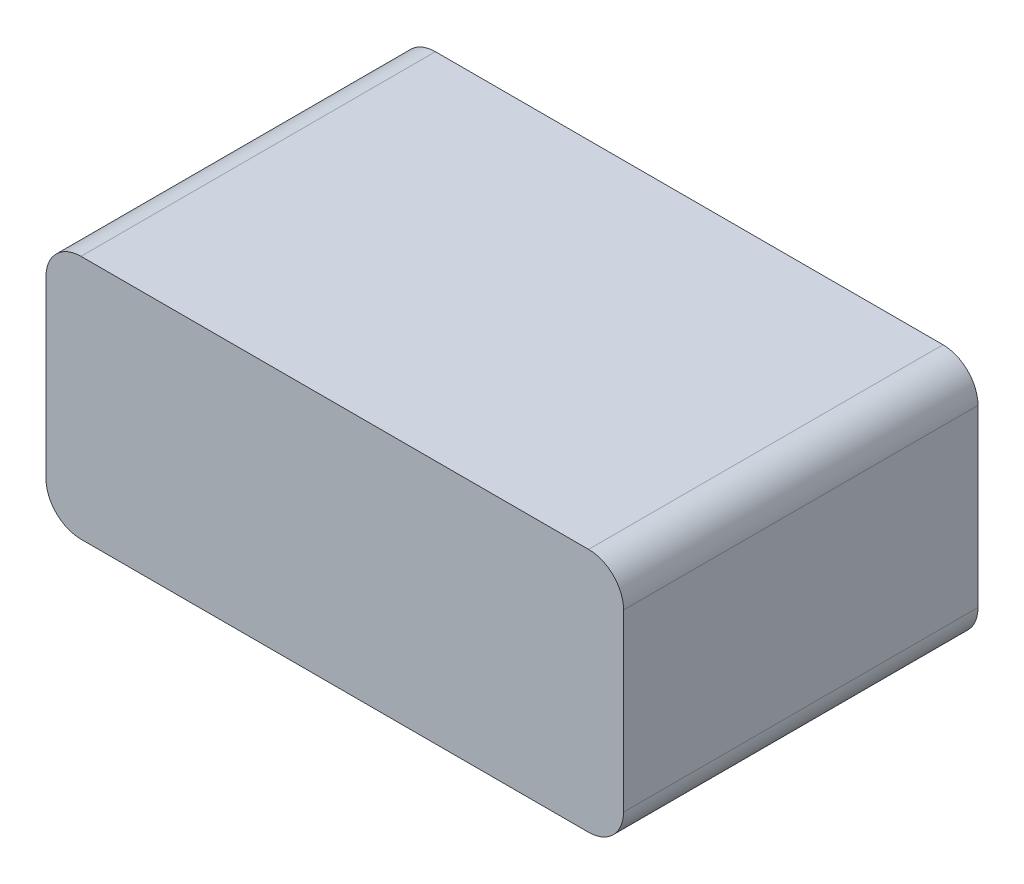
ISO-10303-21;
HEADER;
FILE_DESCRIPTION(('STEP AP214'),'2;1');
FILE_NAME('part.step','',(''),(''),'','','');
FILE_SCHEMA(('AUTOMOTIVE_DESIGN { 1 0 10303 214 1 1 1 1 }'));
ENDSEC;
DATA;
#1=APPLICATION_CONTEXT('core data for automotive mechanical design processes');
#2=APPLICATION_PROTOCOL_DEFINITION('international standard','automotive_design',2000,#1);
#3=PRODUCT_CONTEXT('',#1,'mechanical');
#4=PRODUCT('Part','Part','',(#3));
#5=PRODUCT_RELATED_PRODUCT_CATEGORY('part','',(#4));
#6=PRODUCT_DEFINITION_FORMATION('','',#4);
#7=PRODUCT_DEFINITION_CONTEXT('part definition',#1,'design');
#8=PRODUCT_DEFINITION('design','',#6,#7);
#9=PRODUCT_DEFINITION_SHAPE('','',#8);
#10=(LENGTH_UNIT() NAMED_UNIT(*) SI_UNIT(.MILLI.,.METRE.));
#11=(NAMED_UNIT(*) PLANE_ANGLE_UNIT() SI_UNIT($,.RADIAN.));
#12=(NAMED_UNIT(*) SI_UNIT($,.STERADIAN.) SOLID_ANGLE_UNIT());
#13=UNCERTAINTY_MEASURE_WITH_UNIT(LENGTH_MEASURE(1.E-05),#10,'distance_accuracy_value','');
#14=(GEOMETRIC_REPRESENTATION_CONTEXT(3) GLOBAL_UNCERTAINTY_ASSIGNED_CONTEXT((#13)) GLOBAL_UNIT_ASSIGNED_CONTEXT((#10,
#11,#12)) REPRESENTATION_CONTEXT('',''));
#15=CARTESIAN_POINT('',(0.,0.,0.));
#16=DIRECTION('',(0.,0.,1.));
#17=DIRECTION('',(1.,0.,0.));
#18=AXIS2_PLACEMENT_3D('',#15,#16,#17);
#19=CARTESIAN_POINT('',(-25.1978332784297,88.9,-92.3086918461163));
#20=DIRECTION('',(1.,0.,0.));
#21=DIRECTION('',(0.,0.,-1.));
#22=AXIS2_PLACEMENT_3D('',#19,#20,#21);
#23=PLANE('',#22);
#24=DIRECTION('',(0.,-1.,0.));
#25=VECTOR('',#24,1.);
#26=CARTESIAN_POINT('',(-25.1978332784297,88.9,-92.3086918461163));
#27=LINE('',#26,#25);
#28=CARTESIAN_POINT('',(-25.1978332784297,76.2,-92.3086918461163));
#29=VERTEX_POINT('',#28);
#30=CARTESIAN_POINT('',(-25.1978332784297,12.7,-92.3086918461163));
#31=VERTEX_POINT('',#30);
#32=EDGE_CURVE('E216',#29,#31,#27,.T.);
#33=ORIENTED_EDGE('',*,*,#32,.T.);
#34=DIRECTION('',(0.,0.,1.));
#35=VECTOR('',#34,1.);
#36=CARTESIAN_POINT('',(-25.1978332784297,12.7,-92.3086918461163));
#37=LINE('',#36,#35);
#38=CARTESIAN_POINT('',(-25.1978332784297,12.7,36.2788081538837));
#39=VERTEX_POINT('',#38);
#40=EDGE_CURVE('E249',#31,#39,#37,.T.);
#41=ORIENTED_EDGE('',*,*,#40,.T.);
#42=DIRECTION('',(0.,-1.,0.));
#43=VECTOR('',#42,1.);
#44=CARTESIAN_POINT('',(-25.1978332784297,88.9,36.2788081538837));
#45=LINE('',#44,#43);
#46=CARTESIAN_POINT('',(-25.1978332784297,76.2,36.2788081538837));
#47=VERTEX_POINT('',#46);
#48=EDGE_CURVE('E227',#47,#39,#45,.T.);
#49=ORIENTED_EDGE('',*,*,#48,.F.);
#50=DIRECTION('',(0.,0.,1.));
#51=VECTOR('',#50,1.);
#52=CARTESIAN_POINT('',(-25.1978332784297,76.2,-92.3086918461163));
#53=LINE('',#52,#51);
#54=EDGE_CURVE('E245',#47,#29,#53,.F.);
#55=ORIENTED_EDGE('',*,*,#54,.T.);
#56=EDGE_LOOP('',(#33,#41,#49,#55));
#57=FACE_BOUND('',#56,.T.);
#58=ADVANCED_FACE('F33',(#57),#23,.F.);
#59=CARTESIAN_POINT('',(-25.1978332784297,88.9,36.2788081538837));
#60=DIRECTION('',(0.,0.,-1.));
#61=DIRECTION('',(-1.,0.,0.));
#62=AXIS2_PLACEMENT_3D('',#59,#60,#61);
#63=PLANE('',#62);
#64=DIRECTION('',(1.,0.,0.));
#65=VECTOR('',#64,1.);
#66=CARTESIAN_POINT('',(-25.1978332784297,0.,36.2788081538837));
#67=LINE('',#66,#65);
#68=CARTESIAN_POINT('',(-12.4978332784297,0.,36.2788081538837));
#69=VERTEX_POINT('',#68);
#70=CARTESIAN_POINT('',(171.65216672157,0.,36.2788081538837));
#71=VERTEX_POINT('',#70);
#72=EDGE_CURVE('E158',#69,#71,#67,.T.);
#73=ORIENTED_EDGE('',*,*,#72,.T.);
#74=CARTESIAN_POINT('',(171.65216672157,12.7,36.2788081538837));
#75=DIRECTION('',(0.,0.,-1.));
#76=DIRECTION('',(-1.,0.,0.));
#77=AXIS2_PLACEMENT_3D('',#74,#75,#76);
#78=CIRCLE('',#77,12.7);
#79=CARTESIAN_POINT('',(184.35216672157,12.7,36.2788081538837));
#80=VERTEX_POINT('',#79);
#81=EDGE_CURVE('E11',#71,#80,#78,.F.);
#82=ORIENTED_EDGE('',*,*,#81,.T.);
#83=DIRECTION('',(0.,-1.,0.));
#84=VECTOR('',#83,1.);
#85=CARTESIAN_POINT('',(184.35216672157,88.9,36.2788081538837));
#86=LINE('',#85,#84);
#87=CARTESIAN_POINT('',(184.35216672157,76.2,36.2788081538837));
#88=VERTEX_POINT('',#87);
#89=EDGE_CURVE('E224',#88,#80,#86,.T.);
#90=ORIENTED_EDGE('',*,*,#89,.F.);
#91=CARTESIAN_POINT('',(171.65216672157,76.2,36.2788081538837));
#92=DIRECTION('',(0.,0.,-1.));
#93=DIRECTION('',(-1.,0.,0.));
#94=AXIS2_PLACEMENT_3D('',#91,#92,#93);
#95=CIRCLE('',#94,12.7);
#96=CARTESIAN_POINT('',(171.65216672157,88.9,36.2788081538837));
#97=VERTEX_POINT('',#96);
#98=EDGE_CURVE('E237',#88,#97,#95,.F.);
#99=ORIENTED_EDGE('',*,*,#98,.T.);
#100=DIRECTION('',(1.,0.,0.));
#101=VECTOR('',#100,1.);
#102=CARTESIAN_POINT('',(-25.1978332784297,88.9,36.2788081538837));
#103=LINE('',#102,#101);
#104=CARTESIAN_POINT('',(-12.4978332784297,88.9,36.2788081538837));
#105=VERTEX_POINT('',#104);
#106=EDGE_CURVE('E210',#105,#97,#103,.T.);
#107=ORIENTED_EDGE('',*,*,#106,.F.);
#108=CARTESIAN_POINT('',(-12.4978332784297,76.2,36.2788081538837));
#109=DIRECTION('',(0.,0.,-1.));
#110=DIRECTION('',(-1.,0.,0.));
#111=AXIS2_PLACEMENT_3D('',#108,#109,#110);
#112=CIRCLE('',#111,12.7);
#113=EDGE_CURVE('E243',#105,#47,#112,.F.);
#114=ORIENTED_EDGE('',*,*,#113,.T.);
#115=ORIENTED_EDGE('',*,*,#48,.T.);
#116=CARTESIAN_POINT('',(-12.4978332784297,12.7,36.2788081538837));
#117=DIRECTION('',(0.,0.,-1.));
#118=DIRECTION('',(-1.,0.,0.));
#119=AXIS2_PLACEMENT_3D('',#116,#117,#118);
#120=CIRCLE('',#119,12.7);
#121=EDGE_CURVE('E252',#39,#69,#120,.F.);
#122=ORIENTED_EDGE('',*,*,#121,.T.);
#123=EDGE_LOOP('',(#73,#82,#90,#99,#107,#114,#115,#122));
#124=FACE_BOUND('',#123,.T.);
#125=ADVANCED_FACE('F274',(#124),#63,.F.);
#126=CARTESIAN_POINT('',(184.35216672157,88.9,-92.3086918461163));
#127=DIRECTION('',(-1.,0.,0.));
#128=DIRECTION('',(0.,0.,1.));
#129=AXIS2_PLACEMENT_3D('',#126,#127,#128);
#130=PLANE('',#129);
#131=ORIENTED_EDGE('',*,*,#89,.T.);
#132=DIRECTION('',(0.,0.,-1.));
#133=VECTOR('',#132,1.);
#134=CARTESIAN_POINT('',(184.35216672157,12.7,-92.3086918461163));
#135=LINE('',#134,#133);
#136=CARTESIAN_POINT('',(184.35216672157,12.7,-92.3086918461163));
#137=VERTEX_POINT('',#136);
#138=EDGE_CURVE('E259',#80,#137,#135,.T.);
#139=ORIENTED_EDGE('',*,*,#138,.T.);
#140=DIRECTION('',(0.,-1.,0.));
#141=VECTOR('',#140,1.);
#142=CARTESIAN_POINT('',(184.35216672157,88.9,-92.3086918461163));
#143=LINE('',#142,#141);
#144=CARTESIAN_POINT('',(184.35216672157,76.2,-92.3086918461163));
#145=VERTEX_POINT('',#144);
#146=EDGE_CURVE('E221',#145,#137,#143,.T.);
#147=ORIENTED_EDGE('',*,*,#146,.F.);
#148=DIRECTION('',(0.,0.,-1.));
#149=VECTOR('',#148,1.);
#150=CARTESIAN_POINT('',(184.35216672157,76.2,36.2788081538837));
#151=LINE('',#150,#149);
#152=EDGE_CURVE('E235',#145,#88,#151,.F.);
#153=ORIENTED_EDGE('',*,*,#152,.T.);
#154=EDGE_LOOP('',(#131,#139,#147,#153));
#155=FACE_BOUND('',#154,.T.);
#156=ADVANCED_FACE('F277',(#155),#130,.F.);
#157=CARTESIAN_POINT('',(-25.1978332784297,88.9,-92.3086918461163));
#158=DIRECTION('',(0.,0.,1.));
#159=DIRECTION('',(1.,0.,0.));
#160=AXIS2_PLACEMENT_3D('',#157,#158,#159);
#161=PLANE('',#160);
#162=DIRECTION('',(0.,-1.,0.));
#163=VECTOR('',#162,1.);
#164=CARTESIAN_POINT('',(181.81216672157,88.9,-92.3086918461163));
#165=LINE('',#164,#163);
#166=CARTESIAN_POINT('',(181.81216672157,76.2,-92.3086918461163));
#167=VERTEX_POINT('',#166);
#168=CARTESIAN_POINT('',(181.81216672157,12.7,-92.3086918461163));
#169=VERTEX_POINT('',#168);
#170=EDGE_CURVE('E169',#167,#169,#165,.T.);
#171=ORIENTED_EDGE('',*,*,#170,.F.);
#172=CARTESIAN_POINT('',(171.65216672157,76.2,-92.3086918461163));
#173=DIRECTION('',(0.,0.,1.));
#174=DIRECTION('',(1.,0.,0.));
#175=AXIS2_PLACEMENT_3D('',#172,#173,#174);
#176=CIRCLE('',#175,10.16);
#177=CARTESIAN_POINT('',(171.65216672157,86.36,-92.3086918461163));
#178=VERTEX_POINT('',#177);
#179=EDGE_CURVE('E186',#178,#167,#176,.F.);
#180=ORIENTED_EDGE('',*,*,#179,.F.);
#181=DIRECTION('',(-1.,0.,0.));
#182=VECTOR('',#181,1.);
#183=CARTESIAN_POINT('',(-25.1978332784297,86.36,-92.3086918461163));
#184=LINE('',#183,#182);
#185=CARTESIAN_POINT('',(-12.4978332784297,86.36,-92.3086918461163));
#186=VERTEX_POINT('',#185);
#187=EDGE_CURVE('E48',#178,#186,#184,.T.);
#188=ORIENTED_EDGE('',*,*,#187,.T.);
#189=CARTESIAN_POINT('',(-12.4978332784297,76.2,-92.3086918461163));
#190=DIRECTION('',(0.,0.,1.));
#191=DIRECTION('',(1.,0.,0.));
#192=AXIS2_PLACEMENT_3D('',#189,#190,#191);
#193=CIRCLE('',#192,10.16);
#194=CARTESIAN_POINT('',(-22.6578332784297,76.2,-92.3086918461163));
#195=VERTEX_POINT('',#194);
#196=EDGE_CURVE('E199',#195,#186,#193,.F.);
#197=ORIENTED_EDGE('',*,*,#196,.F.);
#198=DIRECTION('',(0.,-1.,0.));
#199=VECTOR('',#198,1.);
#200=CARTESIAN_POINT('',(-22.6578332784297,88.9,-92.3086918461163));
#201=LINE('',#200,#199);
#202=CARTESIAN_POINT('',(-22.6578332784297,12.7,-92.3086918461163));
#203=VERTEX_POINT('',#202);
#204=EDGE_CURVE('E196',#195,#203,#201,.T.);
#205=ORIENTED_EDGE('',*,*,#204,.T.);
#206=CARTESIAN_POINT('',(-12.4978332784297,12.7,-92.3086918461163));
#207=DIRECTION('',(0.,0.,1.));
#208=DIRECTION('',(1.,0.,0.));
#209=AXIS2_PLACEMENT_3D('',#206,#207,#208);
#210=CIRCLE('',#209,10.16);
#211=CARTESIAN_POINT('',(-12.4978332784297,2.54,-92.3086918461163));
#212=VERTEX_POINT('',#211);
#213=EDGE_CURVE('E175',#212,#203,#210,.F.);
#214=ORIENTED_EDGE('',*,*,#213,.F.);
#215=DIRECTION('',(-1.,0.,0.));
#216=VECTOR('',#215,1.);
#217=CARTESIAN_POINT('',(-25.1978332784297,2.54,-92.3086918461163));
#218=LINE('',#217,#216);
#219=CARTESIAN_POINT('',(171.65216672157,2.54,-92.3086918461163));
#220=VERTEX_POINT('',#219);
#221=EDGE_CURVE('E207',#220,#212,#218,.T.);
#222=ORIENTED_EDGE('',*,*,#221,.F.);
#223=CARTESIAN_POINT('',(171.65216672157,12.7,-92.3086918461163));
#224=DIRECTION('',(0.,0.,1.));
#225=DIRECTION('',(1.,0.,0.));
#226=AXIS2_PLACEMENT_3D('',#223,#224,#225);
#227=CIRCLE('',#226,10.16);
#228=EDGE_CURVE('E174',#169,#220,#227,.F.);
#229=ORIENTED_EDGE('',*,*,#228,.F.);
#230=EDGE_LOOP('',(#171,#180,#188,#197,#205,#214,#222,#229));
#231=FACE_BOUND('',#230,.T.);
#232=ORIENTED_EDGE('',*,*,#146,.T.);
#233=CARTESIAN_POINT('',(171.65216672157,12.7,-92.3086918461163));
#234=DIRECTION('',(0.,0.,1.));
#235=DIRECTION('',(1.,0.,0.));
#236=AXIS2_PLACEMENT_3D('',#233,#234,#235);
#237=CIRCLE('',#236,12.7);
#238=CARTESIAN_POINT('',(171.65216672157,0.,-92.3086918461163));
#239=VERTEX_POINT('',#238);
#240=EDGE_CURVE('E262',#137,#239,#237,.F.);
#241=ORIENTED_EDGE('',*,*,#240,.T.);
#242=DIRECTION('',(-1.,0.,0.));
#243=VECTOR('',#242,1.);
#244=CARTESIAN_POINT('',(-25.1978332784297,0.,-92.3086918461163));
#245=LINE('',#244,#243);
#246=CARTESIAN_POINT('',(-12.4978332784297,0.,-92.3086918461163));
#247=VERTEX_POINT('',#246);
#248=EDGE_CURVE('E213',#239,#247,#245,.T.);
#249=ORIENTED_EDGE('',*,*,#248,.T.);
#250=CARTESIAN_POINT('',(-12.4978332784297,12.7,-92.3086918461163));
#251=DIRECTION('',(0.,0.,1.));
#252=DIRECTION('',(1.,0.,0.));
#253=AXIS2_PLACEMENT_3D('',#250,#251,#252);
#254=CIRCLE('',#253,12.7);
#255=EDGE_CURVE('E257',#247,#31,#254,.F.);
#256=ORIENTED_EDGE('',*,*,#255,.T.);
#257=ORIENTED_EDGE('',*,*,#32,.F.);
#258=CARTESIAN_POINT('',(-12.4978332784297,76.2,-92.3086918461163));
#259=DIRECTION('',(0.,0.,1.));
#260=DIRECTION('',(1.,0.,0.));
#261=AXIS2_PLACEMENT_3D('',#258,#259,#260);
#262=CIRCLE('',#261,12.7);
#263=CARTESIAN_POINT('',(-12.4978332784297,88.9,-92.3086918461163));
#264=VERTEX_POINT('',#263);
#265=EDGE_CURVE('E247',#29,#264,#262,.F.);
#266=ORIENTED_EDGE('',*,*,#265,.T.);
#267=DIRECTION('',(-1.,0.,0.));
#268=VECTOR('',#267,1.);
#269=CARTESIAN_POINT('',(-25.1978332784297,88.9,-92.3086918461163));
#270=LINE('',#269,#268);
#271=CARTESIAN_POINT('',(171.65216672157,88.9,-92.3086918461163));
#272=VERTEX_POINT('',#271);
#273=EDGE_CURVE('E212',#272,#264,#270,.T.);
#274=ORIENTED_EDGE('',*,*,#273,.F.);
#275=CARTESIAN_POINT('',(171.65216672157,76.2,-92.3086918461163));
#276=DIRECTION('',(0.,0.,1.));
#277=DIRECTION('',(1.,0.,0.));
#278=AXIS2_PLACEMENT_3D('',#275,#276,#277);
#279=CIRCLE('',#278,12.7);
#280=EDGE_CURVE('E233',#272,#145,#279,.F.);
#281=ORIENTED_EDGE('',*,*,#280,.T.);
#282=EDGE_LOOP('',(#232,#241,#249,#256,#257,#266,#274,#281));
#283=FACE_BOUND('',#282,.T.);
#284=ADVANCED_FACE('F264',(#231,#283),#161,.F.);
#285=CARTESIAN_POINT('',(0.,88.9,0.));
#286=DIRECTION('',(0.,1.,0.));
#287=DIRECTION('',(0.,0.,1.));
#288=AXIS2_PLACEMENT_3D('',#285,#286,#287);
#289=PLANE('',#288);
#290=ORIENTED_EDGE('',*,*,#273,.T.);
#291=DIRECTION('',(0.,0.,1.));
#292=VECTOR('',#291,1.);
#293=CARTESIAN_POINT('',(-12.4978332784297,88.9,36.2788081538837));
#294=LINE('',#293,#292);
#295=EDGE_CURVE('E240',#264,#105,#294,.T.);
#296=ORIENTED_EDGE('',*,*,#295,.T.);
#297=ORIENTED_EDGE('',*,*,#106,.T.);
#298=DIRECTION('',(0.,0.,-1.));
#299=VECTOR('',#298,1.);
#300=CARTESIAN_POINT('',(171.65216672157,88.9,-92.3086918461163));
#301=LINE('',#300,#299);
#302=EDGE_CURVE('E230',#97,#272,#301,.T.);
#303=ORIENTED_EDGE('',*,*,#302,.T.);
#304=EDGE_LOOP('',(#290,#296,#297,#303));
#305=FACE_BOUND('',#304,.T.);
#306=ADVANCED_FACE('F285',(#305),#289,.T.);
#307=CARTESIAN_POINT('',(0.,0.,0.));
#308=DIRECTION('',(0.,1.,0.));
#309=DIRECTION('',(0.,0.,1.));
#310=AXIS2_PLACEMENT_3D('',#307,#308,#309);
#311=PLANE('',#310);
#312=ORIENTED_EDGE('',*,*,#248,.F.);
#313=DIRECTION('',(0.,0.,-1.));
#314=VECTOR('',#313,1.);
#315=CARTESIAN_POINT('',(171.65216672157,0.,0.));
#316=LINE('',#315,#314);
#317=EDGE_CURVE('E41',#239,#71,#316,.F.);
#318=ORIENTED_EDGE('',*,*,#317,.T.);
#319=ORIENTED_EDGE('',*,*,#72,.F.);
#320=DIRECTION('',(0.,0.,1.));
#321=VECTOR('',#320,1.);
#322=CARTESIAN_POINT('',(-12.4978332784297,0.,0.));
#323=LINE('',#322,#321);
#324=EDGE_CURVE('E254',#69,#247,#323,.F.);
#325=ORIENTED_EDGE('',*,*,#324,.T.);
#326=EDGE_LOOP('',(#312,#318,#319,#325));
#327=FACE_BOUND('',#326,.T.);
#328=ADVANCED_FACE('F268',(#327),#311,.F.);
#329=CARTESIAN_POINT('',(171.65216672157,76.2,0.));
#330=DIRECTION('',(0.,0.,1.));
#331=DIRECTION('',(1.,0.,0.));
#332=AXIS2_PLACEMENT_3D('',#329,#330,#331);
#333=CYLINDRICAL_SURFACE('',#332,12.7);
#334=ORIENTED_EDGE('',*,*,#98,.F.);
#335=ORIENTED_EDGE('',*,*,#152,.F.);
#336=ORIENTED_EDGE('',*,*,#280,.F.);
#337=ORIENTED_EDGE('',*,*,#302,.F.);
#338=EDGE_LOOP('',(#334,#335,#336,#337));
#339=FACE_BOUND('',#338,.T.);
#340=ADVANCED_FACE('F280',(#339),#333,.T.);
#341=CARTESIAN_POINT('',(-12.4978332784297,76.2,0.));
#342=DIRECTION('',(0.,0.,-1.));
#343=DIRECTION('',(-1.,0.,0.));
#344=AXIS2_PLACEMENT_3D('',#341,#342,#343);
#345=CYLINDRICAL_SURFACE('',#344,12.7);
#346=ORIENTED_EDGE('',*,*,#265,.F.);
#347=ORIENTED_EDGE('',*,*,#54,.F.);
#348=ORIENTED_EDGE('',*,*,#113,.F.);
#349=ORIENTED_EDGE('',*,*,#295,.F.);
#350=EDGE_LOOP('',(#346,#347,#348,#349));
#351=FACE_BOUND('',#350,.T.);
#352=ADVANCED_FACE('F290',(#351),#345,.T.);
#353=CARTESIAN_POINT('',(-12.4978332784297,12.7,-92.3086918461163));
#354=DIRECTION('',(0.,0.,1.));
#355=DIRECTION('',(1.,0.,0.));
#356=AXIS2_PLACEMENT_3D('',#353,#354,#355);
#357=CYLINDRICAL_SURFACE('',#356,12.7);
#358=ORIENTED_EDGE('',*,*,#255,.F.);
#359=ORIENTED_EDGE('',*,*,#324,.F.);
#360=ORIENTED_EDGE('',*,*,#121,.F.);
#361=ORIENTED_EDGE('',*,*,#40,.F.);
#362=EDGE_LOOP('',(#358,#359,#360,#361));
#363=FACE_BOUND('',#362,.T.);
#364=ADVANCED_FACE('F296',(#363),#357,.T.);
#365=CARTESIAN_POINT('',(171.65216672157,12.7,-92.3086918461163));
#366=DIRECTION('',(0.,0.,-1.));
#367=DIRECTION('',(-1.,0.,0.));
#368=AXIS2_PLACEMENT_3D('',#365,#366,#367);
#369=CYLINDRICAL_SURFACE('',#368,12.7);
#370=ORIENTED_EDGE('',*,*,#81,.F.);
#371=ORIENTED_EDGE('',*,*,#317,.F.);
#372=ORIENTED_EDGE('',*,*,#240,.F.);
#373=ORIENTED_EDGE('',*,*,#138,.F.);
#374=EDGE_LOOP('',(#370,#371,#372,#373));
#375=FACE_BOUND('',#374,.T.);
#376=ADVANCED_FACE('F35',(#375),#369,.T.);
#377=CARTESIAN_POINT('',(-22.6578332784297,88.9,-92.3086918461163));
#378=DIRECTION('',(1.,0.,0.));
#379=DIRECTION('',(0.,0.,-1.));
#380=AXIS2_PLACEMENT_3D('',#377,#378,#379);
#381=PLANE('',#380);
#382=ORIENTED_EDGE('',*,*,#204,.F.);
#383=DIRECTION('',(0.,0.,-1.));
#384=VECTOR('',#383,1.);
#385=CARTESIAN_POINT('',(-22.6578332784297,76.2,-92.3086918461163));
#386=LINE('',#385,#384);
#387=CARTESIAN_POINT('',(-22.6578332784297,76.2,33.7388081538837));
#388=VERTEX_POINT('',#387);
#389=EDGE_CURVE('E202',#388,#195,#386,.T.);
#390=ORIENTED_EDGE('',*,*,#389,.F.);
#391=DIRECTION('',(0.,-1.,0.));
#392=VECTOR('',#391,1.);
#393=CARTESIAN_POINT('',(-22.6578332784297,88.9,33.7388081538837));
#394=LINE('',#393,#392);
#395=CARTESIAN_POINT('',(-22.6578332784297,12.7,33.7388081538837));
#396=VERTEX_POINT('',#395);
#397=EDGE_CURVE('E168',#388,#396,#394,.T.);
#398=ORIENTED_EDGE('',*,*,#397,.T.);
#399=DIRECTION('',(0.,0.,-1.));
#400=VECTOR('',#399,1.);
#401=CARTESIAN_POINT('',(-22.6578332784297,12.7,-92.3086918461163));
#402=LINE('',#401,#400);
#403=EDGE_CURVE('E201',#203,#396,#402,.F.);
#404=ORIENTED_EDGE('',*,*,#403,.F.);
#405=EDGE_LOOP('',(#382,#390,#398,#404));
#406=FACE_BOUND('',#405,.T.);
#407=ADVANCED_FACE('F302',(#406),#381,.T.);
#408=CARTESIAN_POINT('',(-25.1978332784297,88.9,33.7388081538837));
#409=DIRECTION('',(0.,0.,-1.));
#410=DIRECTION('',(-1.,0.,0.));
#411=AXIS2_PLACEMENT_3D('',#408,#409,#410);
#412=PLANE('',#411);
#413=DIRECTION('',(1.,0.,0.));
#414=VECTOR('',#413,1.);
#415=CARTESIAN_POINT('',(-25.1978332784297,2.54,33.7388081538837));
#416=LINE('',#415,#414);
#417=CARTESIAN_POINT('',(-12.4978332784297,2.54,33.7388081538837));
#418=VERTEX_POINT('',#417);
#419=CARTESIAN_POINT('',(171.65216672157,2.54,33.7388081538837));
#420=VERTEX_POINT('',#419);
#421=EDGE_CURVE('E208',#418,#420,#416,.T.);
#422=ORIENTED_EDGE('',*,*,#421,.F.);
#423=CARTESIAN_POINT('',(-12.4978332784297,12.7,33.7388081538837));
#424=DIRECTION('',(0.,0.,-1.));
#425=DIRECTION('',(-1.,0.,0.));
#426=AXIS2_PLACEMENT_3D('',#423,#424,#425);
#427=CIRCLE('',#426,10.16);
#428=EDGE_CURVE('E182',#396,#418,#427,.F.);
#429=ORIENTED_EDGE('',*,*,#428,.F.);
#430=ORIENTED_EDGE('',*,*,#397,.F.);
#431=CARTESIAN_POINT('',(-12.4978332784297,76.2,33.7388081538837));
#432=DIRECTION('',(0.,0.,-1.));
#433=DIRECTION('',(-1.,0.,0.));
#434=AXIS2_PLACEMENT_3D('',#431,#432,#433);
#435=CIRCLE('',#434,10.16);
#436=CARTESIAN_POINT('',(-12.4978332784297,86.36,33.7388081538837));
#437=VERTEX_POINT('',#436);
#438=EDGE_CURVE('E192',#437,#388,#435,.F.);
#439=ORIENTED_EDGE('',*,*,#438,.F.);
#440=DIRECTION('',(1.,0.,0.));
#441=VECTOR('',#440,1.);
#442=CARTESIAN_POINT('',(-25.1978332784297,86.36,33.7388081538837));
#443=LINE('',#442,#441);
#444=CARTESIAN_POINT('',(171.65216672157,86.36,33.7388081538837));
#445=VERTEX_POINT('',#444);
#446=EDGE_CURVE('E204',#437,#445,#443,.T.);
#447=ORIENTED_EDGE('',*,*,#446,.T.);
#448=CARTESIAN_POINT('',(171.65216672157,76.2,33.7388081538837));
#449=DIRECTION('',(0.,0.,-1.));
#450=DIRECTION('',(-1.,0.,0.));
#451=AXIS2_PLACEMENT_3D('',#448,#449,#450);
#452=CIRCLE('',#451,10.16);
#453=CARTESIAN_POINT('',(181.81216672157,76.2,33.7388081538837));
#454=VERTEX_POINT('',#453);
#455=EDGE_CURVE('E165',#454,#445,#452,.F.);
#456=ORIENTED_EDGE('',*,*,#455,.F.);
#457=DIRECTION('',(0.,-1.,0.));
#458=VECTOR('',#457,1.);
#459=CARTESIAN_POINT('',(181.81216672157,88.9,33.7388081538837));
#460=LINE('',#459,#458);
#461=CARTESIAN_POINT('',(181.81216672157,12.7,33.7388081538837));
#462=VERTEX_POINT('',#461);
#463=EDGE_CURVE('E162',#454,#462,#460,.T.);
#464=ORIENTED_EDGE('',*,*,#463,.T.);
#465=CARTESIAN_POINT('',(171.65216672157,12.7,33.7388081538837));
#466=DIRECTION('',(0.,0.,-1.));
#467=DIRECTION('',(-1.,0.,0.));
#468=AXIS2_PLACEMENT_3D('',#465,#466,#467);
#469=CIRCLE('',#468,10.16);
#470=EDGE_CURVE('E147',#420,#462,#469,.F.);
#471=ORIENTED_EDGE('',*,*,#470,.F.);
#472=EDGE_LOOP('',(#422,#429,#430,#439,#447,#456,#464,#471));
#473=FACE_BOUND('',#472,.T.);
#474=ADVANCED_FACE('F163',(#473),#412,.T.);
#475=CARTESIAN_POINT('',(181.81216672157,88.9,-92.3086918461163));
#476=DIRECTION('',(-1.,0.,0.));
#477=DIRECTION('',(0.,0.,1.));
#478=AXIS2_PLACEMENT_3D('',#475,#476,#477);
#479=PLANE('',#478);
#480=ORIENTED_EDGE('',*,*,#463,.F.);
#481=DIRECTION('',(0.,0.,1.));
#482=VECTOR('',#481,1.);
#483=CARTESIAN_POINT('',(181.81216672157,76.2,-92.3086918461163));
#484=LINE('',#483,#482);
#485=EDGE_CURVE('E184',#167,#454,#484,.T.);
#486=ORIENTED_EDGE('',*,*,#485,.F.);
#487=ORIENTED_EDGE('',*,*,#170,.T.);
#488=DIRECTION('',(0.,0.,1.));
#489=VECTOR('',#488,1.);
#490=CARTESIAN_POINT('',(181.81216672157,12.7,-92.3086918461163));
#491=LINE('',#490,#489);
#492=EDGE_CURVE('E151',#462,#169,#491,.F.);
#493=ORIENTED_EDGE('',*,*,#492,.F.);
#494=EDGE_LOOP('',(#480,#486,#487,#493));
#495=FACE_BOUND('',#494,.T.);
#496=ADVANCED_FACE('F171',(#495),#479,.T.);
#497=CARTESIAN_POINT('',(0.,86.36,0.));
#498=DIRECTION('',(0.,1.,0.));
#499=DIRECTION('',(0.,0.,1.));
#500=AXIS2_PLACEMENT_3D('',#497,#498,#499);
#501=PLANE('',#500);
#502=ORIENTED_EDGE('',*,*,#187,.F.);
#503=DIRECTION('',(0.,0.,1.));
#504=VECTOR('',#503,1.);
#505=CARTESIAN_POINT('',(171.65216672157,86.36,0.));
#506=LINE('',#505,#504);
#507=EDGE_CURVE('E187',#445,#178,#506,.F.);
#508=ORIENTED_EDGE('',*,*,#507,.F.);
#509=ORIENTED_EDGE('',*,*,#446,.F.);
#510=DIRECTION('',(0.,0.,1.));
#511=VECTOR('',#510,1.);
#512=CARTESIAN_POINT('',(-12.4978332784297,86.36,0.));
#513=LINE('',#512,#511);
#514=EDGE_CURVE('E189',#186,#437,#513,.T.);
#515=ORIENTED_EDGE('',*,*,#514,.F.);
#516=EDGE_LOOP('',(#502,#508,#509,#515));
#517=FACE_BOUND('',#516,.T.);
#518=ADVANCED_FACE('F393',(#517),#501,.F.);
#519=CARTESIAN_POINT('',(0.,2.54,0.));
#520=DIRECTION('',(0.,1.,0.));
#521=DIRECTION('',(0.,0.,1.));
#522=AXIS2_PLACEMENT_3D('',#519,#520,#521);
#523=PLANE('',#522);
#524=ORIENTED_EDGE('',*,*,#221,.T.);
#525=DIRECTION('',(0.,0.,1.));
#526=VECTOR('',#525,1.);
#527=CARTESIAN_POINT('',(-12.4978332784297,2.54,0.));
#528=LINE('',#527,#526);
#529=EDGE_CURVE('E178',#418,#212,#528,.F.);
#530=ORIENTED_EDGE('',*,*,#529,.F.);
#531=ORIENTED_EDGE('',*,*,#421,.T.);
#532=DIRECTION('',(0.,0.,1.));
#533=VECTOR('',#532,1.);
#534=CARTESIAN_POINT('',(171.65216672157,2.54,0.));
#535=LINE('',#534,#533);
#536=EDGE_CURVE('E154',#220,#420,#535,.T.);
#537=ORIENTED_EDGE('',*,*,#536,.F.);
#538=EDGE_LOOP('',(#524,#530,#531,#537));
#539=FACE_BOUND('',#538,.T.);
#540=ADVANCED_FACE('F401',(#539),#523,.T.);
#541=CARTESIAN_POINT('',(171.65216672157,76.2,0.));
#542=DIRECTION('',(0.,0.,1.));
#543=DIRECTION('',(1.,0.,0.));
#544=AXIS2_PLACEMENT_3D('',#541,#542,#543);
#545=CYLINDRICAL_SURFACE('',#544,10.16);
#546=ORIENTED_EDGE('',*,*,#455,.T.);
#547=ORIENTED_EDGE('',*,*,#507,.T.);
#548=ORIENTED_EDGE('',*,*,#179,.T.);
#549=ORIENTED_EDGE('',*,*,#485,.T.);
#550=EDGE_LOOP('',(#546,#547,#548,#549));
#551=FACE_BOUND('',#550,.T.);
#552=ADVANCED_FACE('F409',(#551),#545,.F.);
#553=CARTESIAN_POINT('',(-12.4978332784297,76.2,0.));
#554=DIRECTION('',(0.,0.,-1.));
#555=DIRECTION('',(-1.,0.,0.));
#556=AXIS2_PLACEMENT_3D('',#553,#554,#555);
#557=CYLINDRICAL_SURFACE('',#556,10.16);
#558=ORIENTED_EDGE('',*,*,#196,.T.);
#559=ORIENTED_EDGE('',*,*,#514,.T.);
#560=ORIENTED_EDGE('',*,*,#438,.T.);
#561=ORIENTED_EDGE('',*,*,#389,.T.);
#562=EDGE_LOOP('',(#558,#559,#560,#561));
#563=FACE_BOUND('',#562,.T.);
#564=ADVANCED_FACE('F418',(#563),#557,.F.);
#565=CARTESIAN_POINT('',(-12.4978332784297,12.7,-92.3086918461163));
#566=DIRECTION('',(0.,0.,1.));
#567=DIRECTION('',(1.,0.,0.));
#568=AXIS2_PLACEMENT_3D('',#565,#566,#567);
#569=CYLINDRICAL_SURFACE('',#568,10.16);
#570=ORIENTED_EDGE('',*,*,#213,.T.);
#571=ORIENTED_EDGE('',*,*,#403,.T.);
#572=ORIENTED_EDGE('',*,*,#428,.T.);
#573=ORIENTED_EDGE('',*,*,#529,.T.);
#574=EDGE_LOOP('',(#570,#571,#572,#573));
#575=FACE_BOUND('',#574,.T.);
#576=ADVANCED_FACE('F427',(#575),#569,.F.);
#577=CARTESIAN_POINT('',(171.65216672157,12.7,-92.3086918461163));
#578=DIRECTION('',(0.,0.,-1.));
#579=DIRECTION('',(-1.,0.,0.));
#580=AXIS2_PLACEMENT_3D('',#577,#578,#579);
#581=CYLINDRICAL_SURFACE('',#580,10.16);
#582=ORIENTED_EDGE('',*,*,#470,.T.);
#583=ORIENTED_EDGE('',*,*,#492,.T.);
#584=ORIENTED_EDGE('',*,*,#228,.T.);
#585=ORIENTED_EDGE('',*,*,#536,.T.);
#586=EDGE_LOOP('',(#582,#583,#584,#585));
#587=FACE_BOUND('',#586,.T.);
#588=ADVANCED_FACE('F149',(#587),#581,.F.);
#589=CLOSED_SHELL('',(#58,#125,#156,#284,#306,#328,#340,#352,#364,#376,#407,#474,#496,#518,#540,
#552,#564,#576,#588));
#590=MANIFOLD_SOLID_BREP('B2',#589);
#591=ADVANCED_BREP_SHAPE_REPRESENTATION('',(#18,#590),#14);
#592=SHAPE_DEFINITION_REPRESENTATION(#9,#591);
ENDSEC;
END-ISO-10303-21;
